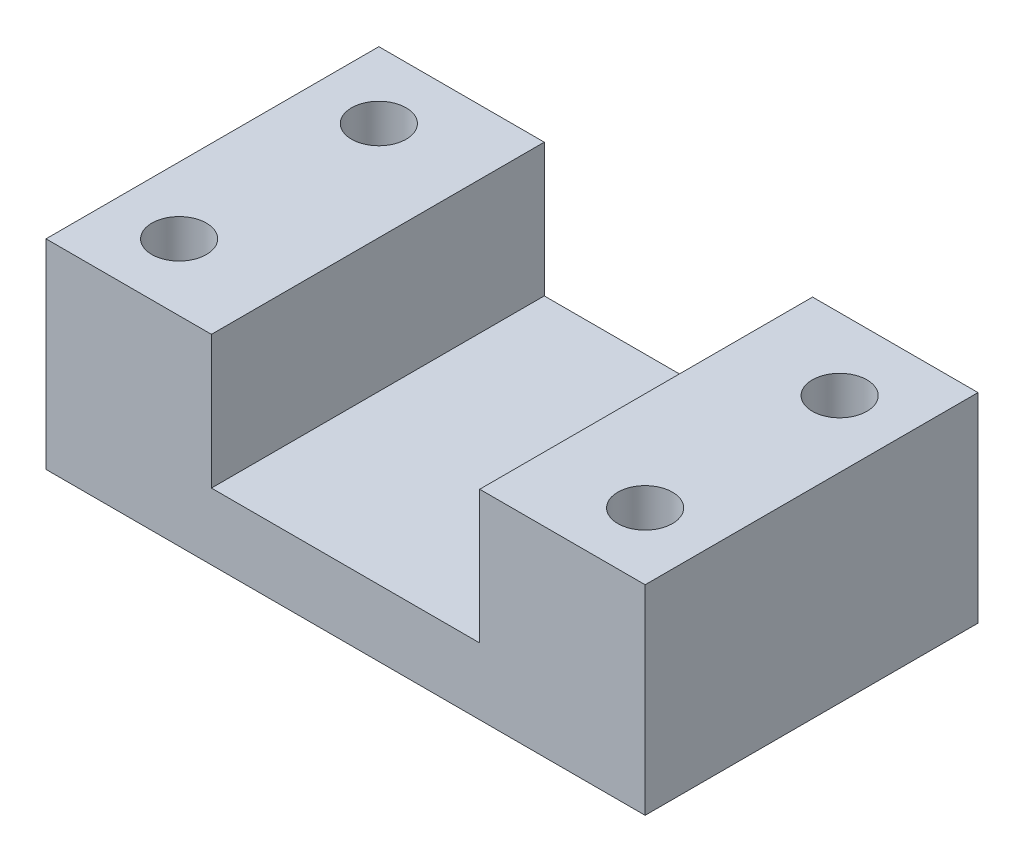
ISO-10303-21;
HEADER;
FILE_DESCRIPTION(('STEP AP214'),'2;1');
FILE_NAME('part.step','',(''),(''),'','','');
FILE_SCHEMA(('AUTOMOTIVE_DESIGN { 1 0 10303 214 1 1 1 1 }'));
ENDSEC;
DATA;
#1=APPLICATION_CONTEXT('core data for automotive mechanical design processes');
#2=APPLICATION_PROTOCOL_DEFINITION('international standard','automotive_design',2000,#1);
#3=PRODUCT_CONTEXT('',#1,'mechanical');
#4=PRODUCT('Part','Part','',(#3));
#5=PRODUCT_RELATED_PRODUCT_CATEGORY('part','',(#4));
#6=PRODUCT_DEFINITION_FORMATION('','',#4);
#7=PRODUCT_DEFINITION_CONTEXT('part definition',#1,'design');
#8=PRODUCT_DEFINITION('design','',#6,#7);
#9=PRODUCT_DEFINITION_SHAPE('','',#8);
#10=(LENGTH_UNIT() NAMED_UNIT(*) SI_UNIT(.MILLI.,.METRE.));
#11=(NAMED_UNIT(*) PLANE_ANGLE_UNIT() SI_UNIT($,.RADIAN.));
#12=(NAMED_UNIT(*) SI_UNIT($,.STERADIAN.) SOLID_ANGLE_UNIT());
#13=UNCERTAINTY_MEASURE_WITH_UNIT(LENGTH_MEASURE(1.E-05),#10,'distance_accuracy_value','');
#14=(GEOMETRIC_REPRESENTATION_CONTEXT(3) GLOBAL_UNCERTAINTY_ASSIGNED_CONTEXT((#13)) GLOBAL_UNIT_ASSIGNED_CONTEXT((#10,
#11,#12)) REPRESENTATION_CONTEXT('',''));
#15=CARTESIAN_POINT('',(0.,0.,0.));
#16=DIRECTION('',(0.,0.,1.));
#17=DIRECTION('',(1.,0.,0.));
#18=AXIS2_PLACEMENT_3D('',#15,#16,#17);
#19=CARTESIAN_POINT('',(-35.,30.,15.));
#20=DIRECTION('',(0.,-1.,0.));
#21=DIRECTION('',(0.,0.,-1.));
#22=AXIS2_PLACEMENT_3D('',#19,#20,#21);
#23=CYLINDRICAL_SURFACE('',#22,4.1);
#24=CARTESIAN_POINT('',(-35.,30.,15.));
#25=DIRECTION('',(0.,-1.,0.));
#26=DIRECTION('',(0.,0.,-1.));
#27=AXIS2_PLACEMENT_3D('',#24,#25,#26);
#28=CIRCLE('',#27,4.1);
#29=CARTESIAN_POINT('',(-35.,30.,10.9));
#30=VERTEX_POINT('',#29);
#31=EDGE_CURVE('E135',#30,#30,#28,.T.);
#32=ORIENTED_EDGE('',*,*,#31,.F.);
#33=EDGE_LOOP('',(#32));
#34=FACE_BOUND('',#33,.T.);
#35=CARTESIAN_POINT('',(-35.,7.,15.));
#36=DIRECTION('',(0.,-1.,0.));
#37=DIRECTION('',(0.,0.,-1.));
#38=AXIS2_PLACEMENT_3D('',#35,#36,#37);
#39=CIRCLE('',#38,4.1);
#40=CARTESIAN_POINT('',(-35.,7.,10.9));
#41=VERTEX_POINT('',#40);
#42=EDGE_CURVE('E39',#41,#41,#39,.F.);
#43=ORIENTED_EDGE('',*,*,#42,.F.);
#44=EDGE_LOOP('',(#43));
#45=FACE_BOUND('',#44,.T.);
#46=ADVANCED_FACE('F35',(#34,#45),#23,.F.);
#47=CARTESIAN_POINT('',(35.,30.,-14.2172732356869));
#48=DIRECTION('',(0.,-1.,0.));
#49=DIRECTION('',(0.,0.,-1.));
#50=AXIS2_PLACEMENT_3D('',#47,#48,#49);
#51=CYLINDRICAL_SURFACE('',#50,4.1);
#52=CARTESIAN_POINT('',(35.,30.,-14.2172732356869));
#53=DIRECTION('',(0.,-1.,0.));
#54=DIRECTION('',(0.,0.,-1.));
#55=AXIS2_PLACEMENT_3D('',#52,#53,#54);
#56=CIRCLE('',#55,4.1);
#57=CARTESIAN_POINT('',(35.,30.,-18.3172732356869));
#58=VERTEX_POINT('',#57);
#59=EDGE_CURVE('E196',#58,#58,#56,.T.);
#60=ORIENTED_EDGE('',*,*,#59,.F.);
#61=EDGE_LOOP('',(#60));
#62=FACE_BOUND('',#61,.T.);
#63=CARTESIAN_POINT('',(35.,7.,-14.2172732356869));
#64=DIRECTION('',(0.,-1.,0.));
#65=DIRECTION('',(0.,0.,-1.));
#66=AXIS2_PLACEMENT_3D('',#63,#64,#65);
#67=CIRCLE('',#66,4.1);
#68=CARTESIAN_POINT('',(35.,7.,-18.3172732356869));
#69=VERTEX_POINT('',#68);
#70=EDGE_CURVE('E176',#69,#69,#67,.F.);
#71=ORIENTED_EDGE('',*,*,#70,.F.);
#72=EDGE_LOOP('',(#71));
#73=FACE_BOUND('',#72,.T.);
#74=ADVANCED_FACE('F229',(#62,#73),#51,.F.);
#75=CARTESIAN_POINT('',(-35.,30.,-15.));
#76=DIRECTION('',(0.,-1.,0.));
#77=DIRECTION('',(0.,0.,-1.));
#78=AXIS2_PLACEMENT_3D('',#75,#76,#77);
#79=CYLINDRICAL_SURFACE('',#78,4.1);
#80=CARTESIAN_POINT('',(-35.,30.,-15.));
#81=DIRECTION('',(0.,-1.,0.));
#82=DIRECTION('',(0.,0.,-1.));
#83=AXIS2_PLACEMENT_3D('',#80,#81,#82);
#84=CIRCLE('',#83,4.1);
#85=CARTESIAN_POINT('',(-35.,30.,-19.1));
#86=VERTEX_POINT('',#85);
#87=EDGE_CURVE('E193',#86,#86,#84,.T.);
#88=ORIENTED_EDGE('',*,*,#87,.F.);
#89=EDGE_LOOP('',(#88));
#90=FACE_BOUND('',#89,.T.);
#91=CARTESIAN_POINT('',(-35.,7.,-15.));
#92=DIRECTION('',(0.,-1.,0.));
#93=DIRECTION('',(0.,0.,-1.));
#94=AXIS2_PLACEMENT_3D('',#91,#92,#93);
#95=CIRCLE('',#94,4.1);
#96=CARTESIAN_POINT('',(-35.,7.,-19.1));
#97=VERTEX_POINT('',#96);
#98=EDGE_CURVE('E174',#97,#97,#95,.F.);
#99=ORIENTED_EDGE('',*,*,#98,.F.);
#100=EDGE_LOOP('',(#99));
#101=FACE_BOUND('',#100,.T.);
#102=ADVANCED_FACE('F208',(#90,#101),#79,.F.);
#103=CARTESIAN_POINT('',(35.,30.,15.));
#104=DIRECTION('',(0.,-1.,0.));
#105=DIRECTION('',(0.,0.,-1.));
#106=AXIS2_PLACEMENT_3D('',#103,#104,#105);
#107=CYLINDRICAL_SURFACE('',#106,4.1);
#108=CARTESIAN_POINT('',(35.,30.,15.));
#109=DIRECTION('',(0.,-1.,0.));
#110=DIRECTION('',(0.,0.,-1.));
#111=AXIS2_PLACEMENT_3D('',#108,#109,#110);
#112=CIRCLE('',#111,4.1);
#113=CARTESIAN_POINT('',(35.,30.,10.9));
#114=VERTEX_POINT('',#113);
#115=EDGE_CURVE('E172',#114,#114,#112,.T.);
#116=ORIENTED_EDGE('',*,*,#115,.F.);
#117=EDGE_LOOP('',(#116));
#118=FACE_BOUND('',#117,.T.);
#119=CARTESIAN_POINT('',(35.,7.,15.));
#120=DIRECTION('',(0.,-1.,0.));
#121=DIRECTION('',(0.,0.,-1.));
#122=AXIS2_PLACEMENT_3D('',#119,#120,#121);
#123=CIRCLE('',#122,4.1);
#124=CARTESIAN_POINT('',(35.,7.,10.9));
#125=VERTEX_POINT('',#124);
#126=EDGE_CURVE('E169',#125,#125,#123,.F.);
#127=ORIENTED_EDGE('',*,*,#126,.F.);
#128=EDGE_LOOP('',(#127));
#129=FACE_BOUND('',#128,.T.);
#130=ADVANCED_FACE('F204',(#118,#129),#107,.F.);
#131=CARTESIAN_POINT('',(0.,30.,0.));
#132=DIRECTION('',(0.,1.,0.));
#133=DIRECTION('',(0.,0.,1.));
#134=AXIS2_PLACEMENT_3D('',#131,#132,#133);
#135=PLANE('',#134);
#136=ORIENTED_EDGE('',*,*,#87,.T.);
#137=EDGE_LOOP('',(#136));
#138=FACE_BOUND('',#137,.T.);
#139=ORIENTED_EDGE('',*,*,#31,.T.);
#140=EDGE_LOOP('',(#139));
#141=FACE_BOUND('',#140,.T.);
#142=DIRECTION('',(0.,0.,1.));
#143=VECTOR('',#142,1.);
#144=CARTESIAN_POINT('',(-20.15,30.,0.));
#145=LINE('',#144,#143);
#146=CARTESIAN_POINT('',(-20.15,30.,-25.));
#147=VERTEX_POINT('',#146);
#148=CARTESIAN_POINT('',(-20.15,30.,25.));
#149=VERTEX_POINT('',#148);
#150=EDGE_CURVE('E11',#147,#149,#145,.T.);
#151=ORIENTED_EDGE('',*,*,#150,.F.);
#152=DIRECTION('',(-1.,0.,0.));
#153=VECTOR('',#152,1.);
#154=CARTESIAN_POINT('',(45.,30.,-25.));
#155=LINE('',#154,#153);
#156=CARTESIAN_POINT('',(-45.,30.,-25.));
#157=VERTEX_POINT('',#156);
#158=EDGE_CURVE('E61',#147,#157,#155,.T.);
#159=ORIENTED_EDGE('',*,*,#158,.T.);
#160=DIRECTION('',(0.,0.,1.));
#161=VECTOR('',#160,1.);
#162=CARTESIAN_POINT('',(-45.,30.,25.));
#163=LINE('',#162,#161);
#164=CARTESIAN_POINT('',(-45.,30.,25.));
#165=VERTEX_POINT('',#164);
#166=EDGE_CURVE('E143',#157,#165,#163,.T.);
#167=ORIENTED_EDGE('',*,*,#166,.T.);
#168=DIRECTION('',(1.,0.,0.));
#169=VECTOR('',#168,1.);
#170=CARTESIAN_POINT('',(45.,30.,25.));
#171=LINE('',#170,#169);
#172=EDGE_CURVE('E91',#165,#149,#171,.T.);
#173=ORIENTED_EDGE('',*,*,#172,.T.);
#174=EDGE_LOOP('',(#151,#159,#167,#173));
#175=FACE_BOUND('',#174,.T.);
#176=ADVANCED_FACE('F207',(#138,#141,#175),#135,.T.);
#177=CARTESIAN_POINT('',(-45.,30.,25.));
#178=DIRECTION('',(1.,0.,0.));
#179=DIRECTION('',(0.,0.,-1.));
#180=AXIS2_PLACEMENT_3D('',#177,#178,#179);
#181=PLANE('',#180);
#182=DIRECTION('',(0.,0.,1.));
#183=VECTOR('',#182,1.);
#184=CARTESIAN_POINT('',(-45.,0.,25.));
#185=LINE('',#184,#183);
#186=CARTESIAN_POINT('',(-45.,0.,-25.));
#187=VERTEX_POINT('',#186);
#188=CARTESIAN_POINT('',(-45.,0.,25.));
#189=VERTEX_POINT('',#188);
#190=EDGE_CURVE('E141',#187,#189,#185,.T.);
#191=ORIENTED_EDGE('',*,*,#190,.T.);
#192=DIRECTION('',(0.,-1.,0.));
#193=VECTOR('',#192,1.);
#194=CARTESIAN_POINT('',(-45.,30.,25.));
#195=LINE('',#194,#193);
#196=EDGE_CURVE('E166',#165,#189,#195,.T.);
#197=ORIENTED_EDGE('',*,*,#196,.F.);
#198=ORIENTED_EDGE('',*,*,#166,.F.);
#199=DIRECTION('',(0.,-1.,0.));
#200=VECTOR('',#199,1.);
#201=CARTESIAN_POINT('',(-45.,30.,-25.));
#202=LINE('',#201,#200);
#203=EDGE_CURVE('E152',#157,#187,#202,.T.);
#204=ORIENTED_EDGE('',*,*,#203,.T.);
#205=EDGE_LOOP('',(#191,#197,#198,#204));
#206=FACE_BOUND('',#205,.T.);
#207=ADVANCED_FACE('F37',(#206),#181,.F.);
#208=CARTESIAN_POINT('',(45.,30.,25.));
#209=DIRECTION('',(0.,0.,-1.));
#210=DIRECTION('',(-1.,0.,0.));
#211=AXIS2_PLACEMENT_3D('',#208,#209,#210);
#212=PLANE('',#211);
#213=DIRECTION('',(1.,0.,0.));
#214=VECTOR('',#213,1.);
#215=CARTESIAN_POINT('',(20.15,10.,25.));
#216=LINE('',#215,#214);
#217=CARTESIAN_POINT('',(-20.15,10.,25.));
#218=VERTEX_POINT('',#217);
#219=CARTESIAN_POINT('',(20.15,10.,25.));
#220=VERTEX_POINT('',#219);
#221=EDGE_CURVE('E132',#218,#220,#216,.T.);
#222=ORIENTED_EDGE('',*,*,#221,.F.);
#223=DIRECTION('',(0.,-1.,0.));
#224=VECTOR('',#223,1.);
#225=CARTESIAN_POINT('',(-20.15,50.,25.));
#226=LINE('',#225,#224);
#227=EDGE_CURVE('E117',#149,#218,#226,.T.);
#228=ORIENTED_EDGE('',*,*,#227,.F.);
#229=ORIENTED_EDGE('',*,*,#172,.F.);
#230=ORIENTED_EDGE('',*,*,#196,.T.);
#231=DIRECTION('',(1.,0.,0.));
#232=VECTOR('',#231,1.);
#233=CARTESIAN_POINT('',(45.,0.,25.));
#234=LINE('',#233,#232);
#235=CARTESIAN_POINT('',(45.,0.,25.));
#236=VERTEX_POINT('',#235);
#237=EDGE_CURVE('E155',#189,#236,#234,.T.);
#238=ORIENTED_EDGE('',*,*,#237,.T.);
#239=DIRECTION('',(0.,-1.,0.));
#240=VECTOR('',#239,1.);
#241=CARTESIAN_POINT('',(45.,30.,25.));
#242=LINE('',#241,#240);
#243=CARTESIAN_POINT('',(45.,30.,25.));
#244=VERTEX_POINT('',#243);
#245=EDGE_CURVE('E163',#244,#236,#242,.T.);
#246=ORIENTED_EDGE('',*,*,#245,.F.);
#247=CARTESIAN_POINT('',(20.15,30.,25.));
#248=VERTEX_POINT('',#247);
#249=EDGE_CURVE('E145',#248,#244,#171,.T.);
#250=ORIENTED_EDGE('',*,*,#249,.F.);
#251=DIRECTION('',(0.,1.,0.));
#252=VECTOR('',#251,1.);
#253=CARTESIAN_POINT('',(20.15,50.,25.));
#254=LINE('',#253,#252);
#255=EDGE_CURVE('E52',#220,#248,#254,.T.);
#256=ORIENTED_EDGE('',*,*,#255,.F.);
#257=EDGE_LOOP('',(#222,#228,#229,#230,#238,#246,#250,#256));
#258=FACE_BOUND('',#257,.T.);
#259=ADVANCED_FACE('F256',(#258),#212,.F.);
#260=CARTESIAN_POINT('',(45.,30.,25.));
#261=DIRECTION('',(-1.,0.,0.));
#262=DIRECTION('',(0.,0.,1.));
#263=AXIS2_PLACEMENT_3D('',#260,#261,#262);
#264=PLANE('',#263);
#265=DIRECTION('',(0.,0.,-1.));
#266=VECTOR('',#265,1.);
#267=CARTESIAN_POINT('',(45.,0.,25.));
#268=LINE('',#267,#266);
#269=CARTESIAN_POINT('',(45.,0.,-25.));
#270=VERTEX_POINT('',#269);
#271=EDGE_CURVE('E157',#236,#270,#268,.T.);
#272=ORIENTED_EDGE('',*,*,#271,.T.);
#273=DIRECTION('',(0.,-1.,0.));
#274=VECTOR('',#273,1.);
#275=CARTESIAN_POINT('',(45.,30.,-25.));
#276=LINE('',#275,#274);
#277=CARTESIAN_POINT('',(45.,30.,-25.));
#278=VERTEX_POINT('',#277);
#279=EDGE_CURVE('E161',#278,#270,#276,.T.);
#280=ORIENTED_EDGE('',*,*,#279,.F.);
#281=DIRECTION('',(0.,0.,-1.));
#282=VECTOR('',#281,1.);
#283=CARTESIAN_POINT('',(45.,30.,25.));
#284=LINE('',#283,#282);
#285=EDGE_CURVE('E147',#244,#278,#284,.T.);
#286=ORIENTED_EDGE('',*,*,#285,.F.);
#287=ORIENTED_EDGE('',*,*,#245,.T.);
#288=EDGE_LOOP('',(#272,#280,#286,#287));
#289=FACE_BOUND('',#288,.T.);
#290=ADVANCED_FACE('F254',(#289),#264,.F.);
#291=CARTESIAN_POINT('',(45.,30.,-25.));
#292=DIRECTION('',(0.,0.,1.));
#293=DIRECTION('',(1.,0.,0.));
#294=AXIS2_PLACEMENT_3D('',#291,#292,#293);
#295=PLANE('',#294);
#296=ORIENTED_EDGE('',*,*,#158,.F.);
#297=DIRECTION('',(0.,-1.,0.));
#298=VECTOR('',#297,1.);
#299=CARTESIAN_POINT('',(-20.15,50.,-25.));
#300=LINE('',#299,#298);
#301=CARTESIAN_POINT('',(-20.15,10.,-25.));
#302=VERTEX_POINT('',#301);
#303=EDGE_CURVE('E116',#147,#302,#300,.T.);
#304=ORIENTED_EDGE('',*,*,#303,.T.);
#305=DIRECTION('',(1.,0.,0.));
#306=VECTOR('',#305,1.);
#307=CARTESIAN_POINT('',(20.15,10.,-25.));
#308=LINE('',#307,#306);
#309=CARTESIAN_POINT('',(20.15,10.,-25.));
#310=VERTEX_POINT('',#309);
#311=EDGE_CURVE('E125',#302,#310,#308,.T.);
#312=ORIENTED_EDGE('',*,*,#311,.T.);
#313=DIRECTION('',(0.,1.,0.));
#314=VECTOR('',#313,1.);
#315=CARTESIAN_POINT('',(20.15,50.,-25.));
#316=LINE('',#315,#314);
#317=CARTESIAN_POINT('',(20.15,30.,-25.));
#318=VERTEX_POINT('',#317);
#319=EDGE_CURVE('E122',#310,#318,#316,.T.);
#320=ORIENTED_EDGE('',*,*,#319,.T.);
#321=EDGE_CURVE('E149',#278,#318,#155,.T.);
#322=ORIENTED_EDGE('',*,*,#321,.F.);
#323=ORIENTED_EDGE('',*,*,#279,.T.);
#324=DIRECTION('',(-1.,0.,0.));
#325=VECTOR('',#324,1.);
#326=CARTESIAN_POINT('',(45.,0.,-25.));
#327=LINE('',#326,#325);
#328=EDGE_CURVE('E83',#270,#187,#327,.T.);
#329=ORIENTED_EDGE('',*,*,#328,.T.);
#330=ORIENTED_EDGE('',*,*,#203,.F.);
#331=EDGE_LOOP('',(#296,#304,#312,#320,#322,#323,#329,#330));
#332=FACE_BOUND('',#331,.T.);
#333=ADVANCED_FACE('F130',(#332),#295,.F.);
#334=ORIENTED_EDGE('',*,*,#59,.T.);
#335=EDGE_LOOP('',(#334));
#336=FACE_BOUND('',#335,.T.);
#337=ORIENTED_EDGE('',*,*,#115,.T.);
#338=EDGE_LOOP('',(#337));
#339=FACE_BOUND('',#338,.T.);
#340=DIRECTION('',(0.,0.,-1.));
#341=VECTOR('',#340,1.);
#342=CARTESIAN_POINT('',(20.15,30.,0.));
#343=LINE('',#342,#341);
#344=EDGE_CURVE('E44',#248,#318,#343,.T.);
#345=ORIENTED_EDGE('',*,*,#344,.F.);
#346=ORIENTED_EDGE('',*,*,#249,.T.);
#347=ORIENTED_EDGE('',*,*,#285,.T.);
#348=ORIENTED_EDGE('',*,*,#321,.T.);
#349=EDGE_LOOP('',(#345,#346,#347,#348));
#350=FACE_BOUND('',#349,.T.);
#351=ADVANCED_FACE('F201',(#336,#339,#350),#135,.T.);
#352=CARTESIAN_POINT('',(0.,0.,0.));
#353=DIRECTION('',(0.,1.,0.));
#354=DIRECTION('',(0.,0.,1.));
#355=AXIS2_PLACEMENT_3D('',#352,#353,#354);
#356=PLANE('',#355);
#357=CARTESIAN_POINT('',(35.,0.,-14.2172732356869));
#358=DIRECTION('',(0.,-1.,0.));
#359=DIRECTION('',(0.,0.,-1.));
#360=AXIS2_PLACEMENT_3D('',#357,#358,#359);
#361=CIRCLE('',#360,8.);
#362=CARTESIAN_POINT('',(35.,0.,-22.2172732356869));
#363=VERTEX_POINT('',#362);
#364=EDGE_CURVE('E315',#363,#363,#361,.T.);
#365=ORIENTED_EDGE('',*,*,#364,.F.);
#366=EDGE_LOOP('',(#365));
#367=FACE_BOUND('',#366,.T.);
#368=CARTESIAN_POINT('',(-35.,0.,15.));
#369=DIRECTION('',(0.,-1.,0.));
#370=DIRECTION('',(0.,0.,-1.));
#371=AXIS2_PLACEMENT_3D('',#368,#369,#370);
#372=CIRCLE('',#371,8.);
#373=CARTESIAN_POINT('',(-35.,0.,7.));
#374=VERTEX_POINT('',#373);
#375=EDGE_CURVE('E323',#374,#374,#372,.T.);
#376=ORIENTED_EDGE('',*,*,#375,.F.);
#377=EDGE_LOOP('',(#376));
#378=FACE_BOUND('',#377,.T.);
#379=CARTESIAN_POINT('',(-35.,0.,-15.));
#380=DIRECTION('',(0.,-1.,0.));
#381=DIRECTION('',(0.,0.,-1.));
#382=AXIS2_PLACEMENT_3D('',#379,#380,#381);
#383=CIRCLE('',#382,8.);
#384=CARTESIAN_POINT('',(-35.,0.,-23.));
#385=VERTEX_POINT('',#384);
#386=EDGE_CURVE('E327',#385,#385,#383,.T.);
#387=ORIENTED_EDGE('',*,*,#386,.F.);
#388=EDGE_LOOP('',(#387));
#389=FACE_BOUND('',#388,.T.);
#390=CARTESIAN_POINT('',(35.,0.,15.));
#391=DIRECTION('',(0.,-1.,0.));
#392=DIRECTION('',(0.,0.,-1.));
#393=AXIS2_PLACEMENT_3D('',#390,#391,#392);
#394=CIRCLE('',#393,8.);
#395=CARTESIAN_POINT('',(35.,0.,7.));
#396=VERTEX_POINT('',#395);
#397=EDGE_CURVE('E182',#396,#396,#394,.T.);
#398=ORIENTED_EDGE('',*,*,#397,.F.);
#399=EDGE_LOOP('',(#398));
#400=FACE_BOUND('',#399,.T.);
#401=ORIENTED_EDGE('',*,*,#190,.F.);
#402=ORIENTED_EDGE('',*,*,#328,.F.);
#403=ORIENTED_EDGE('',*,*,#271,.F.);
#404=ORIENTED_EDGE('',*,*,#237,.F.);
#405=EDGE_LOOP('',(#401,#402,#403,#404));
#406=FACE_BOUND('',#405,.T.);
#407=ADVANCED_FACE('F245',(#367,#378,#389,#400,#406),#356,.F.);
#408=CARTESIAN_POINT('',(-20.15,50.,-25.));
#409=DIRECTION('',(-1.,0.,0.));
#410=DIRECTION('',(0.,-1.,0.));
#411=AXIS2_PLACEMENT_3D('',#408,#409,#410);
#412=PLANE('',#411);
#413=ORIENTED_EDGE('',*,*,#150,.T.);
#414=ORIENTED_EDGE('',*,*,#227,.T.);
#415=DIRECTION('',(0.,0.,1.));
#416=VECTOR('',#415,1.);
#417=CARTESIAN_POINT('',(-20.15,10.,-25.));
#418=LINE('',#417,#416);
#419=EDGE_CURVE('E112',#302,#218,#418,.T.);
#420=ORIENTED_EDGE('',*,*,#419,.F.);
#421=ORIENTED_EDGE('',*,*,#303,.F.);
#422=EDGE_LOOP('',(#413,#414,#420,#421));
#423=FACE_BOUND('',#422,.T.);
#424=ADVANCED_FACE('F114',(#423),#412,.F.);
#425=CARTESIAN_POINT('',(20.15,50.,-25.));
#426=DIRECTION('',(1.,0.,0.));
#427=DIRECTION('',(0.,0.,-1.));
#428=AXIS2_PLACEMENT_3D('',#425,#426,#427);
#429=PLANE('',#428);
#430=ORIENTED_EDGE('',*,*,#344,.T.);
#431=ORIENTED_EDGE('',*,*,#319,.F.);
#432=DIRECTION('',(0.,0.,1.));
#433=VECTOR('',#432,1.);
#434=CARTESIAN_POINT('',(20.15,10.,-25.));
#435=LINE('',#434,#433);
#436=EDGE_CURVE('E121',#310,#220,#435,.T.);
#437=ORIENTED_EDGE('',*,*,#436,.T.);
#438=ORIENTED_EDGE('',*,*,#255,.T.);
#439=EDGE_LOOP('',(#430,#431,#437,#438));
#440=FACE_BOUND('',#439,.T.);
#441=ADVANCED_FACE('F225',(#440),#429,.F.);
#442=CARTESIAN_POINT('',(20.15,10.,-25.));
#443=DIRECTION('',(0.,-1.,0.));
#444=DIRECTION('',(1.,0.,0.));
#445=AXIS2_PLACEMENT_3D('',#442,#443,#444);
#446=PLANE('',#445);
#447=ORIENTED_EDGE('',*,*,#221,.T.);
#448=ORIENTED_EDGE('',*,*,#436,.F.);
#449=ORIENTED_EDGE('',*,*,#311,.F.);
#450=ORIENTED_EDGE('',*,*,#419,.T.);
#451=EDGE_LOOP('',(#447,#448,#449,#450));
#452=FACE_BOUND('',#451,.T.);
#453=ADVANCED_FACE('F126',(#452),#446,.F.);
#454=CARTESIAN_POINT('',(35.,7.,15.));
#455=DIRECTION('',(0.,-1.,0.));
#456=DIRECTION('',(0.,0.,-1.));
#457=AXIS2_PLACEMENT_3D('',#454,#455,#456);
#458=PLANE('',#457);
#459=CARTESIAN_POINT('',(35.,7.,15.));
#460=DIRECTION('',(0.,-1.,0.));
#461=DIRECTION('',(0.,0.,-1.));
#462=AXIS2_PLACEMENT_3D('',#459,#460,#461);
#463=CIRCLE('',#462,8.);
#464=CARTESIAN_POINT('',(35.,7.,7.));
#465=VERTEX_POINT('',#464);
#466=EDGE_CURVE('E173',#465,#465,#463,.T.);
#467=ORIENTED_EDGE('',*,*,#466,.T.);
#468=EDGE_LOOP('',(#467));
#469=FACE_BOUND('',#468,.T.);
#470=ORIENTED_EDGE('',*,*,#126,.T.);
#471=EDGE_LOOP('',(#470));
#472=FACE_BOUND('',#471,.T.);
#473=ADVANCED_FACE('F212',(#469,#472),#458,.T.);
#474=CARTESIAN_POINT('',(35.,7.,15.));
#475=DIRECTION('',(0.,-1.,0.));
#476=DIRECTION('',(0.,0.,-1.));
#477=AXIS2_PLACEMENT_3D('',#474,#475,#476);
#478=CYLINDRICAL_SURFACE('',#477,8.);
#479=ORIENTED_EDGE('',*,*,#466,.F.);
#480=EDGE_LOOP('',(#479));
#481=FACE_BOUND('',#480,.T.);
#482=ORIENTED_EDGE('',*,*,#397,.T.);
#483=EDGE_LOOP('',(#482));
#484=FACE_BOUND('',#483,.T.);
#485=ADVANCED_FACE('F214',(#481,#484),#478,.F.);
#486=CARTESIAN_POINT('',(-35.,7.,-15.));
#487=DIRECTION('',(0.,-1.,0.));
#488=DIRECTION('',(0.,0.,-1.));
#489=AXIS2_PLACEMENT_3D('',#486,#487,#488);
#490=PLANE('',#489);
#491=CARTESIAN_POINT('',(-35.,7.,-15.));
#492=DIRECTION('',(0.,-1.,0.));
#493=DIRECTION('',(0.,0.,-1.));
#494=AXIS2_PLACEMENT_3D('',#491,#492,#493);
#495=CIRCLE('',#494,8.);
#496=CARTESIAN_POINT('',(-35.,7.,-23.));
#497=VERTEX_POINT('',#496);
#498=EDGE_CURVE('E326',#497,#497,#495,.T.);
#499=ORIENTED_EDGE('',*,*,#498,.T.);
#500=EDGE_LOOP('',(#499));
#501=FACE_BOUND('',#500,.T.);
#502=ORIENTED_EDGE('',*,*,#98,.T.);
#503=EDGE_LOOP('',(#502));
#504=FACE_BOUND('',#503,.T.);
#505=ADVANCED_FACE('F221',(#501,#504),#490,.T.);
#506=CARTESIAN_POINT('',(-35.,7.,-15.));
#507=DIRECTION('',(0.,-1.,0.));
#508=DIRECTION('',(0.,0.,-1.));
#509=AXIS2_PLACEMENT_3D('',#506,#507,#508);
#510=CYLINDRICAL_SURFACE('',#509,8.);
#511=ORIENTED_EDGE('',*,*,#498,.F.);
#512=EDGE_LOOP('',(#511));
#513=FACE_BOUND('',#512,.T.);
#514=ORIENTED_EDGE('',*,*,#386,.T.);
#515=EDGE_LOOP('',(#514));
#516=FACE_BOUND('',#515,.T.);
#517=ADVANCED_FACE('F287',(#513,#516),#510,.F.);
#518=CARTESIAN_POINT('',(35.,7.,-14.2172732356869));
#519=DIRECTION('',(0.,-1.,0.));
#520=DIRECTION('',(0.,0.,-1.));
#521=AXIS2_PLACEMENT_3D('',#518,#519,#520);
#522=PLANE('',#521);
#523=CARTESIAN_POINT('',(35.,7.,-14.2172732356869));
#524=DIRECTION('',(0.,-1.,0.));
#525=DIRECTION('',(0.,0.,-1.));
#526=AXIS2_PLACEMENT_3D('',#523,#524,#525);
#527=CIRCLE('',#526,8.);
#528=CARTESIAN_POINT('',(35.,7.,-22.2172732356869));
#529=VERTEX_POINT('',#528);
#530=EDGE_CURVE('E177',#529,#529,#527,.T.);
#531=ORIENTED_EDGE('',*,*,#530,.T.);
#532=EDGE_LOOP('',(#531));
#533=FACE_BOUND('',#532,.T.);
#534=ORIENTED_EDGE('',*,*,#70,.T.);
#535=EDGE_LOOP('',(#534));
#536=FACE_BOUND('',#535,.T.);
#537=ADVANCED_FACE('F293',(#533,#536),#522,.T.);
#538=CARTESIAN_POINT('',(35.,7.,-14.2172732356869));
#539=DIRECTION('',(0.,-1.,0.));
#540=DIRECTION('',(0.,0.,-1.));
#541=AXIS2_PLACEMENT_3D('',#538,#539,#540);
#542=CYLINDRICAL_SURFACE('',#541,8.);
#543=ORIENTED_EDGE('',*,*,#530,.F.);
#544=EDGE_LOOP('',(#543));
#545=FACE_BOUND('',#544,.T.);
#546=ORIENTED_EDGE('',*,*,#364,.T.);
#547=EDGE_LOOP('',(#546));
#548=FACE_BOUND('',#547,.T.);
#549=ADVANCED_FACE('F304',(#545,#548),#542,.F.);
#550=CARTESIAN_POINT('',(-35.,7.,15.));
#551=DIRECTION('',(0.,-1.,0.));
#552=DIRECTION('',(0.,0.,-1.));
#553=AXIS2_PLACEMENT_3D('',#550,#551,#552);
#554=PLANE('',#553);
#555=CARTESIAN_POINT('',(-35.,7.,15.));
#556=DIRECTION('',(0.,-1.,0.));
#557=DIRECTION('',(0.,0.,-1.));
#558=AXIS2_PLACEMENT_3D('',#555,#556,#557);
#559=CIRCLE('',#558,8.);
#560=CARTESIAN_POINT('',(-35.,7.,7.));
#561=VERTEX_POINT('',#560);
#562=EDGE_CURVE('E318',#561,#561,#559,.T.);
#563=ORIENTED_EDGE('',*,*,#562,.T.);
#564=EDGE_LOOP('',(#563));
#565=FACE_BOUND('',#564,.T.);
#566=ORIENTED_EDGE('',*,*,#42,.T.);
#567=EDGE_LOOP('',(#566));
#568=FACE_BOUND('',#567,.T.);
#569=ADVANCED_FACE('F300',(#565,#568),#554,.T.);
#570=CARTESIAN_POINT('',(-35.,7.,15.));
#571=DIRECTION('',(0.,-1.,0.));
#572=DIRECTION('',(0.,0.,-1.));
#573=AXIS2_PLACEMENT_3D('',#570,#571,#572);
#574=CYLINDRICAL_SURFACE('',#573,8.);
#575=ORIENTED_EDGE('',*,*,#562,.F.);
#576=EDGE_LOOP('',(#575));
#577=FACE_BOUND('',#576,.T.);
#578=ORIENTED_EDGE('',*,*,#375,.T.);
#579=EDGE_LOOP('',(#578));
#580=FACE_BOUND('',#579,.T.);
#581=ADVANCED_FACE('F297',(#577,#580),#574,.F.);
#582=CLOSED_SHELL('',(#46,#74,#102,#130,#176,#207,#259,#290,#333,#351,#407,#424,#441,#453,#473,
#485,#505,#517,#537,#549,#569,#581));
#583=MANIFOLD_SOLID_BREP('B2',#582);
#584=ADVANCED_BREP_SHAPE_REPRESENTATION('',(#18,#583),#14);
#585=SHAPE_DEFINITION_REPRESENTATION(#9,#584);
ENDSEC;
END-ISO-10303-21;
